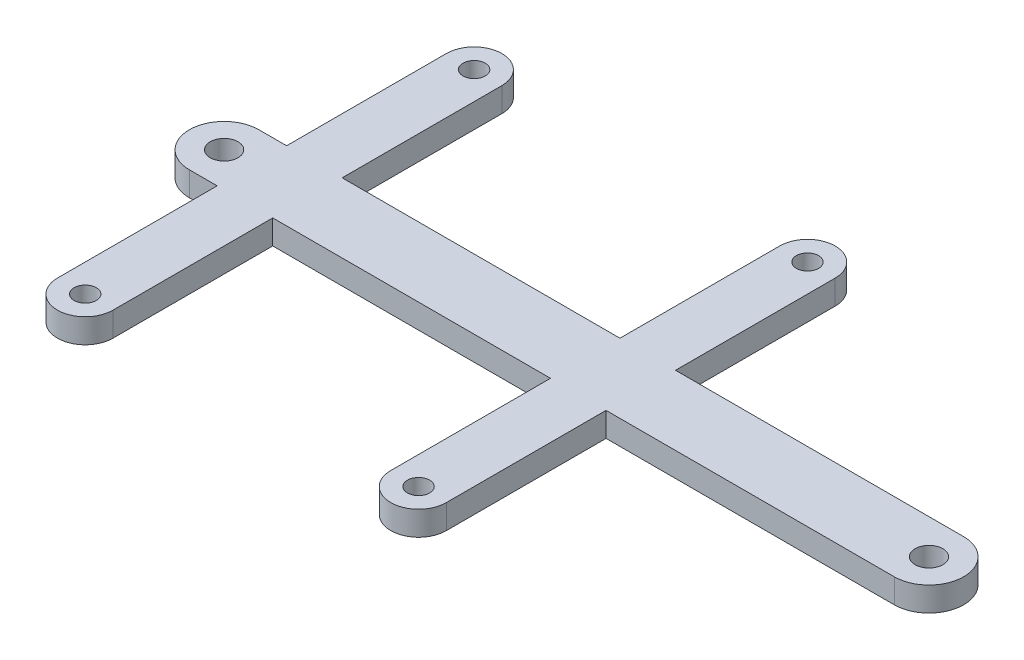
ISO-10303-21;
HEADER;
FILE_DESCRIPTION(('STEP AP214'),'2;1');
FILE_NAME('part.step','',(''),(''),'','','');
FILE_SCHEMA(('AUTOMOTIVE_DESIGN { 1 0 10303 214 1 1 1 1 }'));
ENDSEC;
DATA;
#1=APPLICATION_CONTEXT('core data for automotive mechanical design processes');
#2=APPLICATION_PROTOCOL_DEFINITION('international standard','automotive_design',2000,#1);
#3=PRODUCT_CONTEXT('',#1,'mechanical');
#4=PRODUCT('Part','Part','',(#3));
#5=PRODUCT_RELATED_PRODUCT_CATEGORY('part','',(#4));
#6=PRODUCT_DEFINITION_FORMATION('','',#4);
#7=PRODUCT_DEFINITION_CONTEXT('part definition',#1,'design');
#8=PRODUCT_DEFINITION('design','',#6,#7);
#9=PRODUCT_DEFINITION_SHAPE('','',#8);
#10=(LENGTH_UNIT() NAMED_UNIT(*) SI_UNIT(.MILLI.,.METRE.));
#11=(NAMED_UNIT(*) PLANE_ANGLE_UNIT() SI_UNIT($,.RADIAN.));
#12=(NAMED_UNIT(*) SI_UNIT($,.STERADIAN.) SOLID_ANGLE_UNIT());
#13=UNCERTAINTY_MEASURE_WITH_UNIT(LENGTH_MEASURE(1.E-05),#10,'distance_accuracy_value','');
#14=(GEOMETRIC_REPRESENTATION_CONTEXT(3) GLOBAL_UNCERTAINTY_ASSIGNED_CONTEXT((#13)) GLOBAL_UNIT_ASSIGNED_CONTEXT((#10,
#11,#12)) REPRESENTATION_CONTEXT('',''));
#15=CARTESIAN_POINT('',(0.,0.,0.));
#16=DIRECTION('',(0.,0.,1.));
#17=DIRECTION('',(1.,0.,0.));
#18=AXIS2_PLACEMENT_3D('',#15,#16,#17);
#19=CARTESIAN_POINT('',(6.,3.5,27.9999999999986));
#20=DIRECTION('',(0.,-1.,0.));
#21=DIRECTION('',(0.,0.,-1.));
#22=AXIS2_PLACEMENT_3D('',#19,#20,#21);
#23=CYLINDRICAL_SURFACE('',#22,4.);
#24=CARTESIAN_POINT('',(6.,0.,27.9999999999986));
#25=DIRECTION('',(0.,1.,0.));
#26=DIRECTION('',(0.,0.,1.));
#27=AXIS2_PLACEMENT_3D('',#24,#25,#26);
#28=CIRCLE('',#27,4.);
#29=CARTESIAN_POINT('',(10.,0.,27.9999999999986));
#30=VERTEX_POINT('',#29);
#31=CARTESIAN_POINT('',(2.,0.,27.9999999999986));
#32=VERTEX_POINT('',#31);
#33=EDGE_CURVE('E249',#30,#32,#28,.F.);
#34=ORIENTED_EDGE('',*,*,#33,.F.);
#35=DIRECTION('',(0.,-1.,0.));
#36=VECTOR('',#35,1.);
#37=CARTESIAN_POINT('',(10.,3.5,27.9999999999986));
#38=LINE('',#37,#36);
#39=CARTESIAN_POINT('',(10.,3.5,27.9999999999986));
#40=VERTEX_POINT('',#39);
#41=EDGE_CURVE('E11',#40,#30,#38,.T.);
#42=ORIENTED_EDGE('',*,*,#41,.F.);
#43=CARTESIAN_POINT('',(6.,3.5,27.9999999999986));
#44=DIRECTION('',(0.,1.,0.));
#45=DIRECTION('',(0.,0.,1.));
#46=AXIS2_PLACEMENT_3D('',#43,#44,#45);
#47=CIRCLE('',#46,4.);
#48=CARTESIAN_POINT('',(2.,3.5,27.9999999999986));
#49=VERTEX_POINT('',#48);
#50=EDGE_CURVE('E615',#40,#49,#47,.F.);
#51=ORIENTED_EDGE('',*,*,#50,.T.);
#52=DIRECTION('',(0.,-1.,0.));
#53=VECTOR('',#52,1.);
#54=CARTESIAN_POINT('',(2.,3.5,27.9999999999986));
#55=LINE('',#54,#53);
#56=EDGE_CURVE('E52',#49,#32,#55,.T.);
#57=ORIENTED_EDGE('',*,*,#56,.T.);
#58=EDGE_LOOP('',(#34,#42,#51,#57));
#59=FACE_BOUND('',#58,.T.);
#60=ADVANCED_FACE('F35',(#59),#23,.T.);
#61=CARTESIAN_POINT('',(9.99999999999999,3.5,0.));
#62=DIRECTION('',(-1.,0.,0.));
#63=DIRECTION('',(0.,0.,1.));
#64=AXIS2_PLACEMENT_3D('',#61,#62,#63);
#65=PLANE('',#64);
#66=DIRECTION('',(0.,0.,-1.));
#67=VECTOR('',#66,1.);
#68=CARTESIAN_POINT('',(9.99999999999999,0.,0.));
#69=LINE('',#68,#67);
#70=CARTESIAN_POINT('',(9.99999999999999,0.,4.99999999999846));
#71=VERTEX_POINT('',#70);
#72=EDGE_CURVE('E246',#30,#71,#69,.T.);
#73=ORIENTED_EDGE('',*,*,#72,.T.);
#74=DIRECTION('',(0.,-1.,0.));
#75=VECTOR('',#74,1.);
#76=CARTESIAN_POINT('',(9.99999999999999,3.5,4.99999999999846));
#77=LINE('',#76,#75);
#78=CARTESIAN_POINT('',(9.99999999999999,3.5,4.99999999999846));
#79=VERTEX_POINT('',#78);
#80=EDGE_CURVE('E44',#79,#71,#77,.T.);
#81=ORIENTED_EDGE('',*,*,#80,.F.);
#82=DIRECTION('',(0.,0.,-1.));
#83=VECTOR('',#82,1.);
#84=CARTESIAN_POINT('',(9.99999999999999,3.5,0.));
#85=LINE('',#84,#83);
#86=EDGE_CURVE('E613',#40,#79,#85,.T.);
#87=ORIENTED_EDGE('',*,*,#86,.F.);
#88=ORIENTED_EDGE('',*,*,#41,.T.);
#89=EDGE_LOOP('',(#73,#81,#87,#88));
#90=FACE_BOUND('',#89,.T.);
#91=ADVANCED_FACE('F247',(#90),#65,.F.);
#92=CARTESIAN_POINT('',(0.,3.5,4.99999999999846));
#93=DIRECTION('',(0.,0.,1.));
#94=DIRECTION('',(1.,0.,0.));
#95=AXIS2_PLACEMENT_3D('',#92,#93,#94);
#96=PLANE('',#95);
#97=DIRECTION('',(-1.,0.,0.));
#98=VECTOR('',#97,1.);
#99=CARTESIAN_POINT('',(0.,0.,4.99999999999846));
#100=LINE('',#99,#98);
#101=CARTESIAN_POINT('',(51.5,0.,4.99999999999846));
#102=VERTEX_POINT('',#101);
#103=EDGE_CURVE('E241',#102,#71,#100,.T.);
#104=ORIENTED_EDGE('',*,*,#103,.F.);
#105=DIRECTION('',(0.,-1.,0.));
#106=VECTOR('',#105,1.);
#107=CARTESIAN_POINT('',(51.5,3.5,4.99999999999846));
#108=LINE('',#107,#106);
#109=CARTESIAN_POINT('',(51.5,3.5,4.99999999999846));
#110=VERTEX_POINT('',#109);
#111=EDGE_CURVE('E233',#110,#102,#108,.T.);
#112=ORIENTED_EDGE('',*,*,#111,.F.);
#113=DIRECTION('',(-1.,0.,0.));
#114=VECTOR('',#113,1.);
#115=CARTESIAN_POINT('',(0.,3.5,4.99999999999846));
#116=LINE('',#115,#114);
#117=EDGE_CURVE('E243',#110,#79,#116,.T.);
#118=ORIENTED_EDGE('',*,*,#117,.T.);
#119=ORIENTED_EDGE('',*,*,#80,.T.);
#120=EDGE_LOOP('',(#104,#112,#118,#119));
#121=FACE_BOUND('',#120,.T.);
#122=ADVANCED_FACE('F239',(#121),#96,.T.);
#123=CARTESIAN_POINT('',(51.5,3.5,0.));
#124=DIRECTION('',(0.,-1.,0.));
#125=DIRECTION('',(0.,0.,-1.));
#126=AXIS2_PLACEMENT_3D('',#123,#124,#125);
#127=CYLINDRICAL_SURFACE('',#126,4.99999999999846);
#128=CARTESIAN_POINT('',(51.5,0.,0.));
#129=DIRECTION('',(0.,1.,0.));
#130=DIRECTION('',(0.,0.,1.));
#131=AXIS2_PLACEMENT_3D('',#128,#129,#130);
#132=CIRCLE('',#131,4.99999999999846);
#133=CARTESIAN_POINT('',(51.5,0.,-4.99999999999846));
#134=VERTEX_POINT('',#133);
#135=EDGE_CURVE('E255',#102,#134,#132,.T.);
#136=ORIENTED_EDGE('',*,*,#135,.T.);
#137=DIRECTION('',(0.,-1.,0.));
#138=VECTOR('',#137,1.);
#139=CARTESIAN_POINT('',(51.5,3.5,-4.99999999999846));
#140=LINE('',#139,#138);
#141=CARTESIAN_POINT('',(51.5,3.5,-4.99999999999846));
#142=VERTEX_POINT('',#141);
#143=EDGE_CURVE('E230',#142,#134,#140,.T.);
#144=ORIENTED_EDGE('',*,*,#143,.F.);
#145=CARTESIAN_POINT('',(51.5,3.5,0.));
#146=DIRECTION('',(0.,1.,0.));
#147=DIRECTION('',(0.,0.,1.));
#148=AXIS2_PLACEMENT_3D('',#145,#146,#147);
#149=CIRCLE('',#148,4.99999999999846);
#150=EDGE_CURVE('E610',#110,#142,#149,.T.);
#151=ORIENTED_EDGE('',*,*,#150,.F.);
#152=ORIENTED_EDGE('',*,*,#111,.T.);
#153=EDGE_LOOP('',(#136,#144,#151,#152));
#154=FACE_BOUND('',#153,.T.);
#155=ADVANCED_FACE('F563',(#154),#127,.T.);
#156=CARTESIAN_POINT('',(0.,3.5,-4.99999999999846));
#157=DIRECTION('',(0.,0.,1.));
#158=DIRECTION('',(1.,0.,0.));
#159=AXIS2_PLACEMENT_3D('',#156,#157,#158);
#160=PLANE('',#159);
#161=DIRECTION('',(-1.,0.,0.));
#162=VECTOR('',#161,1.);
#163=CARTESIAN_POINT('',(0.,0.,-4.99999999999846));
#164=LINE('',#163,#162);
#165=CARTESIAN_POINT('',(9.99999999999999,0.,-4.99999999999846));
#166=VERTEX_POINT('',#165);
#167=EDGE_CURVE('E257',#134,#166,#164,.T.);
#168=ORIENTED_EDGE('',*,*,#167,.T.);
#169=DIRECTION('',(0.,-1.,0.));
#170=VECTOR('',#169,1.);
#171=CARTESIAN_POINT('',(9.99999999999999,3.5,-4.99999999999846));
#172=LINE('',#171,#170);
#173=CARTESIAN_POINT('',(9.99999999999999,3.5,-4.99999999999846));
#174=VERTEX_POINT('',#173);
#175=EDGE_CURVE('E228',#174,#166,#172,.T.);
#176=ORIENTED_EDGE('',*,*,#175,.F.);
#177=DIRECTION('',(-1.,0.,0.));
#178=VECTOR('',#177,1.);
#179=CARTESIAN_POINT('',(0.,3.5,-4.99999999999846));
#180=LINE('',#179,#178);
#181=EDGE_CURVE('E611',#142,#174,#180,.T.);
#182=ORIENTED_EDGE('',*,*,#181,.F.);
#183=ORIENTED_EDGE('',*,*,#143,.T.);
#184=EDGE_LOOP('',(#168,#176,#182,#183));
#185=FACE_BOUND('',#184,.T.);
#186=ADVANCED_FACE('F554',(#185),#160,.F.);
#187=CARTESIAN_POINT('',(9.99999999999999,3.5,0.));
#188=DIRECTION('',(1.,0.,0.));
#189=DIRECTION('',(0.,0.,-1.));
#190=AXIS2_PLACEMENT_3D('',#187,#188,#189);
#191=PLANE('',#190);
#192=DIRECTION('',(0.,0.,1.));
#193=VECTOR('',#192,1.);
#194=CARTESIAN_POINT('',(9.99999999999999,0.,0.));
#195=LINE('',#194,#193);
#196=CARTESIAN_POINT('',(10.,0.,-27.9999999999986));
#197=VERTEX_POINT('',#196);
#198=EDGE_CURVE('E263',#197,#166,#195,.T.);
#199=ORIENTED_EDGE('',*,*,#198,.F.);
#200=DIRECTION('',(0.,-1.,0.));
#201=VECTOR('',#200,1.);
#202=CARTESIAN_POINT('',(10.,3.5,-27.9999999999986));
#203=LINE('',#202,#201);
#204=CARTESIAN_POINT('',(10.,3.5,-27.9999999999986));
#205=VERTEX_POINT('',#204);
#206=EDGE_CURVE('E226',#205,#197,#203,.T.);
#207=ORIENTED_EDGE('',*,*,#206,.F.);
#208=DIRECTION('',(0.,0.,1.));
#209=VECTOR('',#208,1.);
#210=CARTESIAN_POINT('',(9.99999999999999,3.5,0.));
#211=LINE('',#210,#209);
#212=EDGE_CURVE('E620',#205,#174,#211,.T.);
#213=ORIENTED_EDGE('',*,*,#212,.T.);
#214=ORIENTED_EDGE('',*,*,#175,.T.);
#215=EDGE_LOOP('',(#199,#207,#213,#214));
#216=FACE_BOUND('',#215,.T.);
#217=ADVANCED_FACE('F545',(#216),#191,.T.);
#218=CARTESIAN_POINT('',(6.,3.5,-27.9999999999986));
#219=DIRECTION('',(0.,-1.,0.));
#220=DIRECTION('',(0.,0.,-1.));
#221=AXIS2_PLACEMENT_3D('',#218,#219,#220);
#222=CYLINDRICAL_SURFACE('',#221,4.);
#223=CARTESIAN_POINT('',(6.,0.,-27.9999999999986));
#224=DIRECTION('',(0.,1.,0.));
#225=DIRECTION('',(0.,0.,1.));
#226=AXIS2_PLACEMENT_3D('',#223,#224,#225);
#227=CIRCLE('',#226,4.);
#228=CARTESIAN_POINT('',(2.,0.,-27.9999999999986));
#229=VERTEX_POINT('',#228);
#230=EDGE_CURVE('E266',#197,#229,#227,.T.);
#231=ORIENTED_EDGE('',*,*,#230,.T.);
#232=DIRECTION('',(0.,-1.,0.));
#233=VECTOR('',#232,1.);
#234=CARTESIAN_POINT('',(2.,3.5,-27.9999999999986));
#235=LINE('',#234,#233);
#236=CARTESIAN_POINT('',(2.,3.5,-27.9999999999986));
#237=VERTEX_POINT('',#236);
#238=EDGE_CURVE('E223',#237,#229,#235,.T.);
#239=ORIENTED_EDGE('',*,*,#238,.F.);
#240=CARTESIAN_POINT('',(6.,3.5,-27.9999999999986));
#241=DIRECTION('',(0.,1.,0.));
#242=DIRECTION('',(0.,0.,1.));
#243=AXIS2_PLACEMENT_3D('',#240,#241,#242);
#244=CIRCLE('',#243,4.);
#245=EDGE_CURVE('E623',#205,#237,#244,.T.);
#246=ORIENTED_EDGE('',*,*,#245,.F.);
#247=ORIENTED_EDGE('',*,*,#206,.T.);
#248=EDGE_LOOP('',(#231,#239,#246,#247));
#249=FACE_BOUND('',#248,.T.);
#250=ADVANCED_FACE('F536',(#249),#222,.T.);
#251=CARTESIAN_POINT('',(2.,3.5,0.));
#252=DIRECTION('',(1.,0.,0.));
#253=DIRECTION('',(0.,0.,-1.));
#254=AXIS2_PLACEMENT_3D('',#251,#252,#253);
#255=PLANE('',#254);
#256=DIRECTION('',(0.,0.,1.));
#257=VECTOR('',#256,1.);
#258=CARTESIAN_POINT('',(2.,0.,0.));
#259=LINE('',#258,#257);
#260=CARTESIAN_POINT('',(2.,0.,-4.99999999999535));
#261=VERTEX_POINT('',#260);
#262=EDGE_CURVE('E269',#229,#261,#259,.T.);
#263=ORIENTED_EDGE('',*,*,#262,.T.);
#264=DIRECTION('',(0.,-1.,0.));
#265=VECTOR('',#264,1.);
#266=CARTESIAN_POINT('',(2.,3.5,-4.99999999999535));
#267=LINE('',#266,#265);
#268=CARTESIAN_POINT('',(2.,3.5,-4.99999999999535));
#269=VERTEX_POINT('',#268);
#270=EDGE_CURVE('E221',#269,#261,#267,.T.);
#271=ORIENTED_EDGE('',*,*,#270,.F.);
#272=DIRECTION('',(0.,0.,1.));
#273=VECTOR('',#272,1.);
#274=CARTESIAN_POINT('',(2.,3.5,0.));
#275=LINE('',#274,#273);
#276=EDGE_CURVE('E626',#237,#269,#275,.T.);
#277=ORIENTED_EDGE('',*,*,#276,.F.);
#278=ORIENTED_EDGE('',*,*,#238,.T.);
#279=EDGE_LOOP('',(#263,#271,#277,#278));
#280=FACE_BOUND('',#279,.T.);
#281=ADVANCED_FACE('F527',(#280),#255,.F.);
#282=CARTESIAN_POINT('',(0.,3.5,-4.99999999999535));
#283=DIRECTION('',(0.,0.,-1.));
#284=DIRECTION('',(-1.,0.,0.));
#285=AXIS2_PLACEMENT_3D('',#282,#283,#284);
#286=PLANE('',#285);
#287=DIRECTION('',(1.,0.,0.));
#288=VECTOR('',#287,1.);
#289=CARTESIAN_POINT('',(0.,0.,-4.99999999999535));
#290=LINE('',#289,#288);
#291=CARTESIAN_POINT('',(-37.9999999999989,0.,-4.99999999999535));
#292=VERTEX_POINT('',#291);
#293=EDGE_CURVE('E272',#292,#261,#290,.T.);
#294=ORIENTED_EDGE('',*,*,#293,.F.);
#295=DIRECTION('',(0.,-1.,0.));
#296=VECTOR('',#295,1.);
#297=CARTESIAN_POINT('',(-37.9999999999989,3.5,-4.99999999999535));
#298=LINE('',#297,#296);
#299=CARTESIAN_POINT('',(-37.9999999999989,3.5,-4.99999999999535));
#300=VERTEX_POINT('',#299);
#301=EDGE_CURVE('E219',#300,#292,#298,.T.);
#302=ORIENTED_EDGE('',*,*,#301,.F.);
#303=DIRECTION('',(1.,0.,0.));
#304=VECTOR('',#303,1.);
#305=CARTESIAN_POINT('',(0.,3.5,-4.99999999999535));
#306=LINE('',#305,#304);
#307=EDGE_CURVE('E628',#300,#269,#306,.T.);
#308=ORIENTED_EDGE('',*,*,#307,.T.);
#309=ORIENTED_EDGE('',*,*,#270,.T.);
#310=EDGE_LOOP('',(#294,#302,#308,#309));
#311=FACE_BOUND('',#310,.T.);
#312=ADVANCED_FACE('F518',(#311),#286,.T.);
#313=CARTESIAN_POINT('',(-37.9999999999989,3.5,0.));
#314=DIRECTION('',(1.,0.,0.));
#315=DIRECTION('',(0.,0.,-1.));
#316=AXIS2_PLACEMENT_3D('',#313,#314,#315);
#317=PLANE('',#316);
#318=DIRECTION('',(0.,0.,1.));
#319=VECTOR('',#318,1.);
#320=CARTESIAN_POINT('',(-37.9999999999989,0.,0.));
#321=LINE('',#320,#319);
#322=CARTESIAN_POINT('',(-37.9999999999989,0.,-27.9999999999953));
#323=VERTEX_POINT('',#322);
#324=EDGE_CURVE('E275',#323,#292,#321,.T.);
#325=ORIENTED_EDGE('',*,*,#324,.F.);
#326=DIRECTION('',(0.,-1.,0.));
#327=VECTOR('',#326,1.);
#328=CARTESIAN_POINT('',(-37.9999999999989,3.5,-27.9999999999953));
#329=LINE('',#328,#327);
#330=CARTESIAN_POINT('',(-37.9999999999989,3.5,-27.9999999999953));
#331=VERTEX_POINT('',#330);
#332=EDGE_CURVE('E217',#331,#323,#329,.T.);
#333=ORIENTED_EDGE('',*,*,#332,.F.);
#334=DIRECTION('',(0.,0.,1.));
#335=VECTOR('',#334,1.);
#336=CARTESIAN_POINT('',(-37.9999999999989,3.5,0.));
#337=LINE('',#336,#335);
#338=EDGE_CURVE('E631',#331,#300,#337,.T.);
#339=ORIENTED_EDGE('',*,*,#338,.T.);
#340=ORIENTED_EDGE('',*,*,#301,.T.);
#341=EDGE_LOOP('',(#325,#333,#339,#340));
#342=FACE_BOUND('',#341,.T.);
#343=ADVANCED_FACE('F509',(#342),#317,.T.);
#344=CARTESIAN_POINT('',(-41.9999999999989,3.5,-27.9999999999953));
#345=DIRECTION('',(0.,-1.,0.));
#346=DIRECTION('',(0.,0.,-1.));
#347=AXIS2_PLACEMENT_3D('',#344,#345,#346);
#348=CYLINDRICAL_SURFACE('',#347,4.);
#349=CARTESIAN_POINT('',(-41.9999999999989,0.,-27.9999999999953));
#350=DIRECTION('',(0.,1.,0.));
#351=DIRECTION('',(0.,0.,1.));
#352=AXIS2_PLACEMENT_3D('',#349,#350,#351);
#353=CIRCLE('',#352,4.);
#354=CARTESIAN_POINT('',(-45.9999999999989,0.,-27.9999999999953));
#355=VERTEX_POINT('',#354);
#356=EDGE_CURVE('E278',#323,#355,#353,.T.);
#357=ORIENTED_EDGE('',*,*,#356,.T.);
#358=DIRECTION('',(0.,-1.,0.));
#359=VECTOR('',#358,1.);
#360=CARTESIAN_POINT('',(-45.9999999999989,3.5,-27.9999999999953));
#361=LINE('',#360,#359);
#362=CARTESIAN_POINT('',(-45.9999999999989,3.5,-27.9999999999953));
#363=VERTEX_POINT('',#362);
#364=EDGE_CURVE('E214',#363,#355,#361,.T.);
#365=ORIENTED_EDGE('',*,*,#364,.F.);
#366=CARTESIAN_POINT('',(-41.9999999999989,3.5,-27.9999999999953));
#367=DIRECTION('',(0.,1.,0.));
#368=DIRECTION('',(0.,0.,1.));
#369=AXIS2_PLACEMENT_3D('',#366,#367,#368);
#370=CIRCLE('',#369,4.);
#371=EDGE_CURVE('E634',#331,#363,#370,.T.);
#372=ORIENTED_EDGE('',*,*,#371,.F.);
#373=ORIENTED_EDGE('',*,*,#332,.T.);
#374=EDGE_LOOP('',(#357,#365,#372,#373));
#375=FACE_BOUND('',#374,.T.);
#376=ADVANCED_FACE('F500',(#375),#348,.T.);
#377=CARTESIAN_POINT('',(-45.9999999999989,3.5,0.));
#378=DIRECTION('',(1.,0.,0.));
#379=DIRECTION('',(0.,0.,-1.));
#380=AXIS2_PLACEMENT_3D('',#377,#378,#379);
#381=PLANE('',#380);
#382=DIRECTION('',(0.,0.,1.));
#383=VECTOR('',#382,1.);
#384=CARTESIAN_POINT('',(-45.9999999999989,0.,0.));
#385=LINE('',#384,#383);
#386=CARTESIAN_POINT('',(-45.9999999999989,0.,-4.99999999999845));
#387=VERTEX_POINT('',#386);
#388=EDGE_CURVE('E281',#355,#387,#385,.T.);
#389=ORIENTED_EDGE('',*,*,#388,.T.);
#390=DIRECTION('',(0.,-1.,0.));
#391=VECTOR('',#390,1.);
#392=CARTESIAN_POINT('',(-45.9999999999989,3.5,-4.99999999999845));
#393=LINE('',#392,#391);
#394=CARTESIAN_POINT('',(-45.9999999999989,3.5,-4.99999999999845));
#395=VERTEX_POINT('',#394);
#396=EDGE_CURVE('E212',#395,#387,#393,.T.);
#397=ORIENTED_EDGE('',*,*,#396,.F.);
#398=DIRECTION('',(0.,0.,1.));
#399=VECTOR('',#398,1.);
#400=CARTESIAN_POINT('',(-45.9999999999989,3.5,0.));
#401=LINE('',#400,#399);
#402=EDGE_CURVE('E637',#363,#395,#401,.T.);
#403=ORIENTED_EDGE('',*,*,#402,.F.);
#404=ORIENTED_EDGE('',*,*,#364,.T.);
#405=EDGE_LOOP('',(#389,#397,#403,#404));
#406=FACE_BOUND('',#405,.T.);
#407=ADVANCED_FACE('F491',(#406),#381,.F.);
#408=CARTESIAN_POINT('',(2.91108283310711E-12,3.5,-4.99999999997167));
#409=DIRECTION('',(5.8221656662472E-13,0.,-1.));
#410=DIRECTION('',(-1.,0.,-5.8221656662472E-13));
#411=AXIS2_PLACEMENT_3D('',#408,#409,#410);
#412=PLANE('',#411);
#413=DIRECTION('',(1.,0.,5.8221656662472E-13));
#414=VECTOR('',#413,1.);
#415=CARTESIAN_POINT('',(2.91108283310711E-12,0.,-4.99999999997167));
#416=LINE('',#415,#414);
#417=CARTESIAN_POINT('',(-49.9999999999989,0.,-5.00000000000078));
#418=VERTEX_POINT('',#417);
#419=EDGE_CURVE('E284',#418,#387,#416,.T.);
#420=ORIENTED_EDGE('',*,*,#419,.F.);
#421=DIRECTION('',(0.,-1.,0.));
#422=VECTOR('',#421,1.);
#423=CARTESIAN_POINT('',(-49.9999999999989,3.5,-5.00000000000078));
#424=LINE('',#423,#422);
#425=CARTESIAN_POINT('',(-49.9999999999989,3.5,-5.00000000000078));
#426=VERTEX_POINT('',#425);
#427=EDGE_CURVE('E210',#426,#418,#424,.T.);
#428=ORIENTED_EDGE('',*,*,#427,.F.);
#429=DIRECTION('',(1.,0.,5.8221656662472E-13));
#430=VECTOR('',#429,1.);
#431=CARTESIAN_POINT('',(2.91108283310711E-12,3.5,-4.99999999997167));
#432=LINE('',#431,#430);
#433=EDGE_CURVE('E639',#426,#395,#432,.T.);
#434=ORIENTED_EDGE('',*,*,#433,.T.);
#435=ORIENTED_EDGE('',*,*,#396,.T.);
#436=EDGE_LOOP('',(#420,#428,#434,#435));
#437=FACE_BOUND('',#436,.T.);
#438=ADVANCED_FACE('F482',(#437),#412,.T.);
#439=CARTESIAN_POINT('',(-49.9999999999989,3.5,-7.76163598317388E-13));
#440=DIRECTION('',(0.,-1.,0.));
#441=DIRECTION('',(0.,0.,-1.));
#442=AXIS2_PLACEMENT_3D('',#439,#440,#441);
#443=CYLINDRICAL_SURFACE('',#442,5.);
#444=CARTESIAN_POINT('',(-49.9999999999989,0.,-7.76163598317388E-13));
#445=DIRECTION('',(0.,1.,0.));
#446=DIRECTION('',(0.,0.,1.));
#447=AXIS2_PLACEMENT_3D('',#444,#445,#446);
#448=CIRCLE('',#447,5.);
#449=CARTESIAN_POINT('',(-49.9999999999989,0.,4.99999999999923));
#450=VERTEX_POINT('',#449);
#451=EDGE_CURVE('E287',#450,#418,#448,.F.);
#452=ORIENTED_EDGE('',*,*,#451,.F.);
#453=DIRECTION('',(0.,-1.,0.));
#454=VECTOR('',#453,1.);
#455=CARTESIAN_POINT('',(-49.9999999999989,3.5,4.99999999999923));
#456=LINE('',#455,#454);
#457=CARTESIAN_POINT('',(-49.9999999999989,3.5,4.99999999999923));
#458=VERTEX_POINT('',#457);
#459=EDGE_CURVE('E208',#458,#450,#456,.T.);
#460=ORIENTED_EDGE('',*,*,#459,.F.);
#461=CARTESIAN_POINT('',(-49.9999999999989,3.5,-7.76163598317388E-13));
#462=DIRECTION('',(0.,1.,0.));
#463=DIRECTION('',(0.,0.,1.));
#464=AXIS2_PLACEMENT_3D('',#461,#462,#463);
#465=CIRCLE('',#464,5.);
#466=EDGE_CURVE('E642',#458,#426,#465,.F.);
#467=ORIENTED_EDGE('',*,*,#466,.T.);
#468=ORIENTED_EDGE('',*,*,#427,.T.);
#469=EDGE_LOOP('',(#452,#460,#467,#468));
#470=FACE_BOUND('',#469,.T.);
#471=ADVANCED_FACE('F473',(#470),#443,.T.);
#472=CARTESIAN_POINT('',(9.70360944372494E-13,3.5,4.99999999998952));
#473=DIRECTION('',(1.94072188874905E-13,0.,1.));
#474=DIRECTION('',(1.,0.,-1.94072188874905E-13));
#475=AXIS2_PLACEMENT_3D('',#472,#473,#474);
#476=PLANE('',#475);
#477=DIRECTION('',(-1.,0.,1.94072188874905E-13));
#478=VECTOR('',#477,1.);
#479=CARTESIAN_POINT('',(9.70360944372494E-13,0.,4.99999999998952));
#480=LINE('',#479,#478);
#481=CARTESIAN_POINT('',(-45.9999999999989,0.,4.99999999999845));
#482=VERTEX_POINT('',#481);
#483=EDGE_CURVE('E290',#482,#450,#480,.T.);
#484=ORIENTED_EDGE('',*,*,#483,.F.);
#485=DIRECTION('',(0.,-1.,0.));
#486=VECTOR('',#485,1.);
#487=CARTESIAN_POINT('',(-45.9999999999989,3.5,4.99999999999845));
#488=LINE('',#487,#486);
#489=CARTESIAN_POINT('',(-45.9999999999989,3.5,4.99999999999845));
#490=VERTEX_POINT('',#489);
#491=EDGE_CURVE('E206',#490,#482,#488,.T.);
#492=ORIENTED_EDGE('',*,*,#491,.F.);
#493=DIRECTION('',(-1.,0.,1.94072188874905E-13));
#494=VECTOR('',#493,1.);
#495=CARTESIAN_POINT('',(9.70360944372494E-13,3.5,4.99999999998952));
#496=LINE('',#495,#494);
#497=EDGE_CURVE('E645',#490,#458,#496,.T.);
#498=ORIENTED_EDGE('',*,*,#497,.T.);
#499=ORIENTED_EDGE('',*,*,#459,.T.);
#500=EDGE_LOOP('',(#484,#492,#498,#499));
#501=FACE_BOUND('',#500,.T.);
#502=ADVANCED_FACE('F464',(#501),#476,.T.);
#503=CARTESIAN_POINT('',(-45.9999999999989,3.5,0.));
#504=DIRECTION('',(-1.,0.,0.));
#505=DIRECTION('',(0.,0.,1.));
#506=AXIS2_PLACEMENT_3D('',#503,#504,#505);
#507=PLANE('',#506);
#508=DIRECTION('',(0.,0.,-1.));
#509=VECTOR('',#508,1.);
#510=CARTESIAN_POINT('',(-45.9999999999989,0.,0.));
#511=LINE('',#510,#509);
#512=CARTESIAN_POINT('',(-45.9999999999989,0.,27.9999999999953));
#513=VERTEX_POINT('',#512);
#514=EDGE_CURVE('E293',#513,#482,#511,.T.);
#515=ORIENTED_EDGE('',*,*,#514,.F.);
#516=DIRECTION('',(0.,-1.,0.));
#517=VECTOR('',#516,1.);
#518=CARTESIAN_POINT('',(-45.9999999999989,3.5,27.9999999999953));
#519=LINE('',#518,#517);
#520=CARTESIAN_POINT('',(-45.9999999999989,3.5,27.9999999999953));
#521=VERTEX_POINT('',#520);
#522=EDGE_CURVE('E200',#521,#513,#519,.T.);
#523=ORIENTED_EDGE('',*,*,#522,.F.);
#524=DIRECTION('',(0.,0.,-1.));
#525=VECTOR('',#524,1.);
#526=CARTESIAN_POINT('',(-45.9999999999989,3.5,0.));
#527=LINE('',#526,#525);
#528=EDGE_CURVE('E648',#521,#490,#527,.T.);
#529=ORIENTED_EDGE('',*,*,#528,.T.);
#530=ORIENTED_EDGE('',*,*,#491,.T.);
#531=EDGE_LOOP('',(#515,#523,#529,#530));
#532=FACE_BOUND('',#531,.T.);
#533=ADVANCED_FACE('F455',(#532),#507,.T.);
#534=CARTESIAN_POINT('',(-41.9999999999989,3.5,27.9999999999953));
#535=DIRECTION('',(0.,-1.,0.));
#536=DIRECTION('',(0.,0.,-1.));
#537=AXIS2_PLACEMENT_3D('',#534,#535,#536);
#538=CYLINDRICAL_SURFACE('',#537,4.);
#539=CARTESIAN_POINT('',(-41.9999999999989,0.,27.9999999999953));
#540=DIRECTION('',(0.,1.,0.));
#541=DIRECTION('',(0.,0.,1.));
#542=AXIS2_PLACEMENT_3D('',#539,#540,#541);
#543=CIRCLE('',#542,4.);
#544=CARTESIAN_POINT('',(-37.9999999999989,0.,27.9999999999953));
#545=VERTEX_POINT('',#544);
#546=EDGE_CURVE('E296',#545,#513,#543,.F.);
#547=ORIENTED_EDGE('',*,*,#546,.F.);
#548=DIRECTION('',(0.,-1.,0.));
#549=VECTOR('',#548,1.);
#550=CARTESIAN_POINT('',(-37.9999999999989,3.5,27.9999999999953));
#551=LINE('',#550,#549);
#552=CARTESIAN_POINT('',(-37.9999999999989,3.5,27.9999999999953));
#553=VERTEX_POINT('',#552);
#554=EDGE_CURVE('E198',#553,#545,#551,.T.);
#555=ORIENTED_EDGE('',*,*,#554,.F.);
#556=CARTESIAN_POINT('',(-41.9999999999989,3.5,27.9999999999953));
#557=DIRECTION('',(0.,1.,0.));
#558=DIRECTION('',(0.,0.,1.));
#559=AXIS2_PLACEMENT_3D('',#556,#557,#558);
#560=CIRCLE('',#559,4.);
#561=EDGE_CURVE('E192',#553,#521,#560,.F.);
#562=ORIENTED_EDGE('',*,*,#561,.T.);
#563=ORIENTED_EDGE('',*,*,#522,.T.);
#564=EDGE_LOOP('',(#547,#555,#562,#563));
#565=FACE_BOUND('',#564,.T.);
#566=ADVANCED_FACE('F447',(#565),#538,.T.);
#567=CARTESIAN_POINT('',(-37.9999999999989,3.5,0.));
#568=DIRECTION('',(-1.,0.,0.));
#569=DIRECTION('',(0.,0.,1.));
#570=AXIS2_PLACEMENT_3D('',#567,#568,#569);
#571=PLANE('',#570);
#572=DIRECTION('',(0.,0.,-1.));
#573=VECTOR('',#572,1.);
#574=CARTESIAN_POINT('',(-37.9999999999989,0.,0.));
#575=LINE('',#574,#573);
#576=CARTESIAN_POINT('',(-37.9999999999989,0.,4.99999999999535));
#577=VERTEX_POINT('',#576);
#578=EDGE_CURVE('E197',#545,#577,#575,.T.);
#579=ORIENTED_EDGE('',*,*,#578,.T.);
#580=DIRECTION('',(0.,-1.,0.));
#581=VECTOR('',#580,1.);
#582=CARTESIAN_POINT('',(-37.9999999999989,3.5,4.99999999999535));
#583=LINE('',#582,#581);
#584=CARTESIAN_POINT('',(-37.9999999999989,3.5,4.99999999999535));
#585=VERTEX_POINT('',#584);
#586=EDGE_CURVE('E178',#585,#577,#583,.T.);
#587=ORIENTED_EDGE('',*,*,#586,.F.);
#588=DIRECTION('',(0.,0.,-1.));
#589=VECTOR('',#588,1.);
#590=CARTESIAN_POINT('',(-37.9999999999989,3.5,0.));
#591=LINE('',#590,#589);
#592=EDGE_CURVE('E183',#553,#585,#591,.T.);
#593=ORIENTED_EDGE('',*,*,#592,.F.);
#594=ORIENTED_EDGE('',*,*,#554,.T.);
#595=EDGE_LOOP('',(#579,#587,#593,#594));
#596=FACE_BOUND('',#595,.T.);
#597=ADVANCED_FACE('F195',(#596),#571,.F.);
#598=CARTESIAN_POINT('',(0.,3.5,4.99999999999535));
#599=DIRECTION('',(0.,0.,-1.));
#600=DIRECTION('',(-1.,0.,0.));
#601=AXIS2_PLACEMENT_3D('',#598,#599,#600);
#602=PLANE('',#601);
#603=DIRECTION('',(1.,0.,0.));
#604=VECTOR('',#603,1.);
#605=CARTESIAN_POINT('',(0.,0.,4.99999999999535));
#606=LINE('',#605,#604);
#607=CARTESIAN_POINT('',(2.,0.,4.99999999999535));
#608=VERTEX_POINT('',#607);
#609=EDGE_CURVE('E300',#577,#608,#606,.T.);
#610=ORIENTED_EDGE('',*,*,#609,.T.);
#611=DIRECTION('',(0.,-1.,0.));
#612=VECTOR('',#611,1.);
#613=CARTESIAN_POINT('',(2.,3.5,4.99999999999535));
#614=LINE('',#613,#612);
#615=CARTESIAN_POINT('',(2.,3.5,4.99999999999535));
#616=VERTEX_POINT('',#615);
#617=EDGE_CURVE('E114',#616,#608,#614,.T.);
#618=ORIENTED_EDGE('',*,*,#617,.F.);
#619=DIRECTION('',(1.,0.,0.));
#620=VECTOR('',#619,1.);
#621=CARTESIAN_POINT('',(0.,3.5,4.99999999999535));
#622=LINE('',#621,#620);
#623=EDGE_CURVE('E174',#585,#616,#622,.T.);
#624=ORIENTED_EDGE('',*,*,#623,.F.);
#625=ORIENTED_EDGE('',*,*,#586,.T.);
#626=EDGE_LOOP('',(#610,#618,#624,#625));
#627=FACE_BOUND('',#626,.T.);
#628=ADVANCED_FACE('F176',(#627),#602,.F.);
#629=CARTESIAN_POINT('',(2.,3.5,0.));
#630=DIRECTION('',(-1.,0.,0.));
#631=DIRECTION('',(0.,0.,1.));
#632=AXIS2_PLACEMENT_3D('',#629,#630,#631);
#633=PLANE('',#632);
#634=DIRECTION('',(0.,0.,-1.));
#635=VECTOR('',#634,1.);
#636=CARTESIAN_POINT('',(2.,0.,0.));
#637=LINE('',#636,#635);
#638=EDGE_CURVE('E302',#32,#608,#637,.T.);
#639=ORIENTED_EDGE('',*,*,#638,.F.);
#640=ORIENTED_EDGE('',*,*,#56,.F.);
#641=DIRECTION('',(0.,0.,-1.));
#642=VECTOR('',#641,1.);
#643=CARTESIAN_POINT('',(2.,3.5,0.));
#644=LINE('',#643,#642);
#645=EDGE_CURVE('E182',#49,#616,#644,.T.);
#646=ORIENTED_EDGE('',*,*,#645,.T.);
#647=ORIENTED_EDGE('',*,*,#617,.T.);
#648=EDGE_LOOP('',(#639,#640,#646,#647));
#649=FACE_BOUND('',#648,.T.);
#650=ADVANCED_FACE('F328',(#649),#633,.T.);
#651=CARTESIAN_POINT('',(-49.9999999999989,3.5,-7.76163598317388E-13));
#652=DIRECTION('',(0.,-1.,0.));
#653=DIRECTION('',(0.,0.,-1.));
#654=AXIS2_PLACEMENT_3D('',#651,#652,#653);
#655=CYLINDRICAL_SURFACE('',#654,2.00000000000087);
#656=CARTESIAN_POINT('',(-49.9999999999989,3.5,-7.76163598317388E-13));
#657=DIRECTION('',(0.,1.,0.));
#658=DIRECTION('',(0.,0.,1.));
#659=AXIS2_PLACEMENT_3D('',#656,#657,#658);
#660=CIRCLE('',#659,2.00000000000087);
#661=CARTESIAN_POINT('',(-49.9999999999989,3.5,2.00000000000009));
#662=VERTEX_POINT('',#661);
#663=EDGE_CURVE('E675',#662,#662,#660,.F.);
#664=ORIENTED_EDGE('',*,*,#663,.F.);
#665=EDGE_LOOP('',(#664));
#666=FACE_BOUND('',#665,.T.);
#667=CARTESIAN_POINT('',(-49.9999999999989,0.,-7.76163598317388E-13));
#668=DIRECTION('',(0.,1.,0.));
#669=DIRECTION('',(0.,0.,1.));
#670=AXIS2_PLACEMENT_3D('',#667,#668,#669);
#671=CIRCLE('',#670,2.00000000000087);
#672=CARTESIAN_POINT('',(-49.9999999999989,0.,2.00000000000009));
#673=VERTEX_POINT('',#672);
#674=EDGE_CURVE('E326',#673,#673,#671,.F.);
#675=ORIENTED_EDGE('',*,*,#674,.T.);
#676=EDGE_LOOP('',(#675));
#677=FACE_BOUND('',#676,.T.);
#678=ADVANCED_FACE('F330',(#666,#677),#655,.F.);
#679=CARTESIAN_POINT('',(51.5,3.5,0.));
#680=DIRECTION('',(0.,-1.,0.));
#681=DIRECTION('',(0.,0.,-1.));
#682=AXIS2_PLACEMENT_3D('',#679,#680,#681);
#683=CYLINDRICAL_SURFACE('',#682,2.);
#684=CARTESIAN_POINT('',(51.5,3.5,0.));
#685=DIRECTION('',(0.,1.,0.));
#686=DIRECTION('',(0.,0.,1.));
#687=AXIS2_PLACEMENT_3D('',#684,#685,#686);
#688=CIRCLE('',#687,2.);
#689=CARTESIAN_POINT('',(51.5,3.5,2.));
#690=VERTEX_POINT('',#689);
#691=EDGE_CURVE('E678',#690,#690,#688,.T.);
#692=ORIENTED_EDGE('',*,*,#691,.T.);
#693=EDGE_LOOP('',(#692));
#694=FACE_BOUND('',#693,.T.);
#695=CARTESIAN_POINT('',(51.5,0.,0.));
#696=DIRECTION('',(0.,1.,0.));
#697=DIRECTION('',(0.,0.,1.));
#698=AXIS2_PLACEMENT_3D('',#695,#696,#697);
#699=CIRCLE('',#698,2.);
#700=CARTESIAN_POINT('',(51.5,0.,2.));
#701=VERTEX_POINT('',#700);
#702=EDGE_CURVE('E323',#701,#701,#699,.T.);
#703=ORIENTED_EDGE('',*,*,#702,.F.);
#704=EDGE_LOOP('',(#703));
#705=FACE_BOUND('',#704,.T.);
#706=ADVANCED_FACE('F336',(#694,#705),#683,.F.);
#707=CARTESIAN_POINT('',(6.,3.5,-27.9999999999986));
#708=DIRECTION('',(0.,-1.,0.));
#709=DIRECTION('',(0.,0.,-1.));
#710=AXIS2_PLACEMENT_3D('',#707,#708,#709);
#711=CYLINDRICAL_SURFACE('',#710,1.60000000000227);
#712=CARTESIAN_POINT('',(6.,3.5,-27.9999999999986));
#713=DIRECTION('',(0.,1.,0.));
#714=DIRECTION('',(0.,0.,1.));
#715=AXIS2_PLACEMENT_3D('',#712,#713,#714);
#716=CIRCLE('',#715,1.60000000000227);
#717=CARTESIAN_POINT('',(6.,3.5,-26.3999999999963));
#718=VERTEX_POINT('',#717);
#719=EDGE_CURVE('E681',#718,#718,#716,.T.);
#720=ORIENTED_EDGE('',*,*,#719,.T.);
#721=EDGE_LOOP('',(#720));
#722=FACE_BOUND('',#721,.T.);
#723=CARTESIAN_POINT('',(6.,0.,-27.9999999999986));
#724=DIRECTION('',(0.,1.,0.));
#725=DIRECTION('',(0.,0.,1.));
#726=AXIS2_PLACEMENT_3D('',#723,#724,#725);
#727=CIRCLE('',#726,1.60000000000227);
#728=CARTESIAN_POINT('',(6.,0.,-26.3999999999963));
#729=VERTEX_POINT('',#728);
#730=EDGE_CURVE('E320',#729,#729,#727,.T.);
#731=ORIENTED_EDGE('',*,*,#730,.F.);
#732=EDGE_LOOP('',(#731));
#733=FACE_BOUND('',#732,.T.);
#734=ADVANCED_FACE('F351',(#722,#733),#711,.F.);
#735=CARTESIAN_POINT('',(-41.9999999999989,3.5,-27.9999999999953));
#736=DIRECTION('',(0.,-1.,0.));
#737=DIRECTION('',(0.,0.,-1.));
#738=AXIS2_PLACEMENT_3D('',#735,#736,#737);
#739=CYLINDRICAL_SURFACE('',#738,1.60000000000519);
#740=CARTESIAN_POINT('',(-41.9999999999989,3.5,-27.9999999999953));
#741=DIRECTION('',(0.,1.,0.));
#742=DIRECTION('',(0.,0.,1.));
#743=AXIS2_PLACEMENT_3D('',#740,#741,#742);
#744=CIRCLE('',#743,1.60000000000519);
#745=CARTESIAN_POINT('',(-41.9999999999989,3.5,-26.3999999999901));
#746=VERTEX_POINT('',#745);
#747=EDGE_CURVE('E366',#746,#746,#744,.T.);
#748=ORIENTED_EDGE('',*,*,#747,.T.);
#749=EDGE_LOOP('',(#748));
#750=FACE_BOUND('',#749,.T.);
#751=CARTESIAN_POINT('',(-41.9999999999989,0.,-27.9999999999953));
#752=DIRECTION('',(0.,1.,0.));
#753=DIRECTION('',(0.,0.,1.));
#754=AXIS2_PLACEMENT_3D('',#751,#752,#753);
#755=CIRCLE('',#754,1.60000000000519);
#756=CARTESIAN_POINT('',(-41.9999999999989,0.,-26.3999999999901));
#757=VERTEX_POINT('',#756);
#758=EDGE_CURVE('E317',#757,#757,#755,.T.);
#759=ORIENTED_EDGE('',*,*,#758,.F.);
#760=EDGE_LOOP('',(#759));
#761=FACE_BOUND('',#760,.T.);
#762=ADVANCED_FACE('F354',(#750,#761),#739,.F.);
#763=CARTESIAN_POINT('',(-41.9999999999989,3.5,27.9999999999953));
#764=DIRECTION('',(0.,-1.,0.));
#765=DIRECTION('',(0.,0.,-1.));
#766=AXIS2_PLACEMENT_3D('',#763,#764,#765);
#767=CYLINDRICAL_SURFACE('',#766,1.60000000000428);
#768=CARTESIAN_POINT('',(-41.9999999999989,3.5,27.9999999999953));
#769=DIRECTION('',(0.,1.,0.));
#770=DIRECTION('',(0.,0.,1.));
#771=AXIS2_PLACEMENT_3D('',#768,#769,#770);
#772=CIRCLE('',#771,1.60000000000428);
#773=CARTESIAN_POINT('',(-41.9999999999989,3.5,29.5999999999996));
#774=VERTEX_POINT('',#773);
#775=EDGE_CURVE('E307',#774,#774,#772,.F.);
#776=ORIENTED_EDGE('',*,*,#775,.F.);
#777=EDGE_LOOP('',(#776));
#778=FACE_BOUND('',#777,.T.);
#779=CARTESIAN_POINT('',(-41.9999999999989,0.,27.9999999999953));
#780=DIRECTION('',(0.,1.,0.));
#781=DIRECTION('',(0.,0.,1.));
#782=AXIS2_PLACEMENT_3D('',#779,#780,#781);
#783=CIRCLE('',#782,1.60000000000428);
#784=CARTESIAN_POINT('',(-41.9999999999989,0.,29.5999999999996));
#785=VERTEX_POINT('',#784);
#786=EDGE_CURVE('E314',#785,#785,#783,.F.);
#787=ORIENTED_EDGE('',*,*,#786,.T.);
#788=EDGE_LOOP('',(#787));
#789=FACE_BOUND('',#788,.T.);
#790=ADVANCED_FACE('F37',(#778,#789),#767,.F.);
#791=CARTESIAN_POINT('',(6.,3.5,27.9999999999986));
#792=DIRECTION('',(0.,-1.,0.));
#793=DIRECTION('',(0.,0.,-1.));
#794=AXIS2_PLACEMENT_3D('',#791,#792,#793);
#795=CYLINDRICAL_SURFACE('',#794,1.59999999999963);
#796=CARTESIAN_POINT('',(6.,3.5,27.9999999999986));
#797=DIRECTION('',(0.,1.,0.));
#798=DIRECTION('',(0.,0.,1.));
#799=AXIS2_PLACEMENT_3D('',#796,#797,#798);
#800=CIRCLE('',#799,1.59999999999963);
#801=CARTESIAN_POINT('',(6.,3.5,29.5999999999982));
#802=VERTEX_POINT('',#801);
#803=EDGE_CURVE('E308',#802,#802,#800,.F.);
#804=ORIENTED_EDGE('',*,*,#803,.F.);
#805=EDGE_LOOP('',(#804));
#806=FACE_BOUND('',#805,.T.);
#807=CARTESIAN_POINT('',(6.,0.,27.9999999999986));
#808=DIRECTION('',(0.,1.,0.));
#809=DIRECTION('',(0.,0.,1.));
#810=AXIS2_PLACEMENT_3D('',#807,#808,#809);
#811=CIRCLE('',#810,1.59999999999963);
#812=CARTESIAN_POINT('',(6.,0.,29.5999999999982));
#813=VERTEX_POINT('',#812);
#814=EDGE_CURVE('E305',#813,#813,#811,.F.);
#815=ORIENTED_EDGE('',*,*,#814,.T.);
#816=EDGE_LOOP('',(#815));
#817=FACE_BOUND('',#816,.T.);
#818=ADVANCED_FACE('F361',(#806,#817),#795,.F.);
#819=CARTESIAN_POINT('',(0.,3.5,0.));
#820=DIRECTION('',(0.,1.,0.));
#821=DIRECTION('',(0.,0.,1.));
#822=AXIS2_PLACEMENT_3D('',#819,#820,#821);
#823=PLANE('',#822);
#824=ORIENTED_EDGE('',*,*,#775,.T.);
#825=EDGE_LOOP('',(#824));
#826=FACE_BOUND('',#825,.T.);
#827=ORIENTED_EDGE('',*,*,#747,.F.);
#828=EDGE_LOOP('',(#827));
#829=FACE_BOUND('',#828,.T.);
#830=ORIENTED_EDGE('',*,*,#719,.F.);
#831=EDGE_LOOP('',(#830));
#832=FACE_BOUND('',#831,.T.);
#833=ORIENTED_EDGE('',*,*,#691,.F.);
#834=EDGE_LOOP('',(#833));
#835=FACE_BOUND('',#834,.T.);
#836=ORIENTED_EDGE('',*,*,#663,.T.);
#837=EDGE_LOOP('',(#836));
#838=FACE_BOUND('',#837,.T.);
#839=ORIENTED_EDGE('',*,*,#50,.F.);
#840=ORIENTED_EDGE('',*,*,#86,.T.);
#841=ORIENTED_EDGE('',*,*,#117,.F.);
#842=ORIENTED_EDGE('',*,*,#150,.T.);
#843=ORIENTED_EDGE('',*,*,#181,.T.);
#844=ORIENTED_EDGE('',*,*,#212,.F.);
#845=ORIENTED_EDGE('',*,*,#245,.T.);
#846=ORIENTED_EDGE('',*,*,#276,.T.);
#847=ORIENTED_EDGE('',*,*,#307,.F.);
#848=ORIENTED_EDGE('',*,*,#338,.F.);
#849=ORIENTED_EDGE('',*,*,#371,.T.);
#850=ORIENTED_EDGE('',*,*,#402,.T.);
#851=ORIENTED_EDGE('',*,*,#433,.F.);
#852=ORIENTED_EDGE('',*,*,#466,.F.);
#853=ORIENTED_EDGE('',*,*,#497,.F.);
#854=ORIENTED_EDGE('',*,*,#528,.F.);
#855=ORIENTED_EDGE('',*,*,#561,.F.);
#856=ORIENTED_EDGE('',*,*,#592,.T.);
#857=ORIENTED_EDGE('',*,*,#623,.T.);
#858=ORIENTED_EDGE('',*,*,#645,.F.);
#859=EDGE_LOOP('',(#839,#840,#841,#842,#843,#844,#845,#846,#847,#848,#849,#850,#851,#852,#853,
#854,#855,#856,#857,#858));
#860=FACE_BOUND('',#859,.T.);
#861=ORIENTED_EDGE('',*,*,#803,.T.);
#862=EDGE_LOOP('',(#861));
#863=FACE_BOUND('',#862,.T.);
#864=ADVANCED_FACE('F188',(#826,#829,#832,#835,#838,#860,#863),#823,.T.);
#865=CARTESIAN_POINT('',(0.,0.,0.));
#866=DIRECTION('',(0.,1.,0.));
#867=DIRECTION('',(0.,0.,1.));
#868=AXIS2_PLACEMENT_3D('',#865,#866,#867);
#869=PLANE('',#868);
#870=ORIENTED_EDGE('',*,*,#786,.F.);
#871=EDGE_LOOP('',(#870));
#872=FACE_BOUND('',#871,.T.);
#873=ORIENTED_EDGE('',*,*,#758,.T.);
#874=EDGE_LOOP('',(#873));
#875=FACE_BOUND('',#874,.T.);
#876=ORIENTED_EDGE('',*,*,#730,.T.);
#877=EDGE_LOOP('',(#876));
#878=FACE_BOUND('',#877,.T.);
#879=ORIENTED_EDGE('',*,*,#702,.T.);
#880=EDGE_LOOP('',(#879));
#881=FACE_BOUND('',#880,.T.);
#882=ORIENTED_EDGE('',*,*,#674,.F.);
#883=EDGE_LOOP('',(#882));
#884=FACE_BOUND('',#883,.T.);
#885=ORIENTED_EDGE('',*,*,#33,.T.);
#886=ORIENTED_EDGE('',*,*,#638,.T.);
#887=ORIENTED_EDGE('',*,*,#609,.F.);
#888=ORIENTED_EDGE('',*,*,#578,.F.);
#889=ORIENTED_EDGE('',*,*,#546,.T.);
#890=ORIENTED_EDGE('',*,*,#514,.T.);
#891=ORIENTED_EDGE('',*,*,#483,.T.);
#892=ORIENTED_EDGE('',*,*,#451,.T.);
#893=ORIENTED_EDGE('',*,*,#419,.T.);
#894=ORIENTED_EDGE('',*,*,#388,.F.);
#895=ORIENTED_EDGE('',*,*,#356,.F.);
#896=ORIENTED_EDGE('',*,*,#324,.T.);
#897=ORIENTED_EDGE('',*,*,#293,.T.);
#898=ORIENTED_EDGE('',*,*,#262,.F.);
#899=ORIENTED_EDGE('',*,*,#230,.F.);
#900=ORIENTED_EDGE('',*,*,#198,.T.);
#901=ORIENTED_EDGE('',*,*,#167,.F.);
#902=ORIENTED_EDGE('',*,*,#135,.F.);
#903=ORIENTED_EDGE('',*,*,#103,.T.);
#904=ORIENTED_EDGE('',*,*,#72,.F.);
#905=EDGE_LOOP('',(#885,#886,#887,#888,#889,#890,#891,#892,#893,#894,#895,#896,#897,#898,#899,
#900,#901,#902,#903,#904));
#906=FACE_BOUND('',#905,.T.);
#907=ORIENTED_EDGE('',*,*,#814,.F.);
#908=EDGE_LOOP('',(#907));
#909=FACE_BOUND('',#908,.T.);
#910=ADVANCED_FACE('F252',(#872,#875,#878,#881,#884,#906,#909),#869,.F.);
#911=CLOSED_SHELL('',(#60,#91,#122,#155,#186,#217,#250,#281,#312,#343,#376,#407,#438,#471,#502,
#533,#566,#597,#628,#650,#678,#706,#734,#762,#790,#818,#864,#910));
#912=MANIFOLD_SOLID_BREP('B2',#911);
#913=ADVANCED_BREP_SHAPE_REPRESENTATION('',(#18,#912),#14);
#914=SHAPE_DEFINITION_REPRESENTATION(#9,#913);
ENDSEC;
END-ISO-10303-21;
